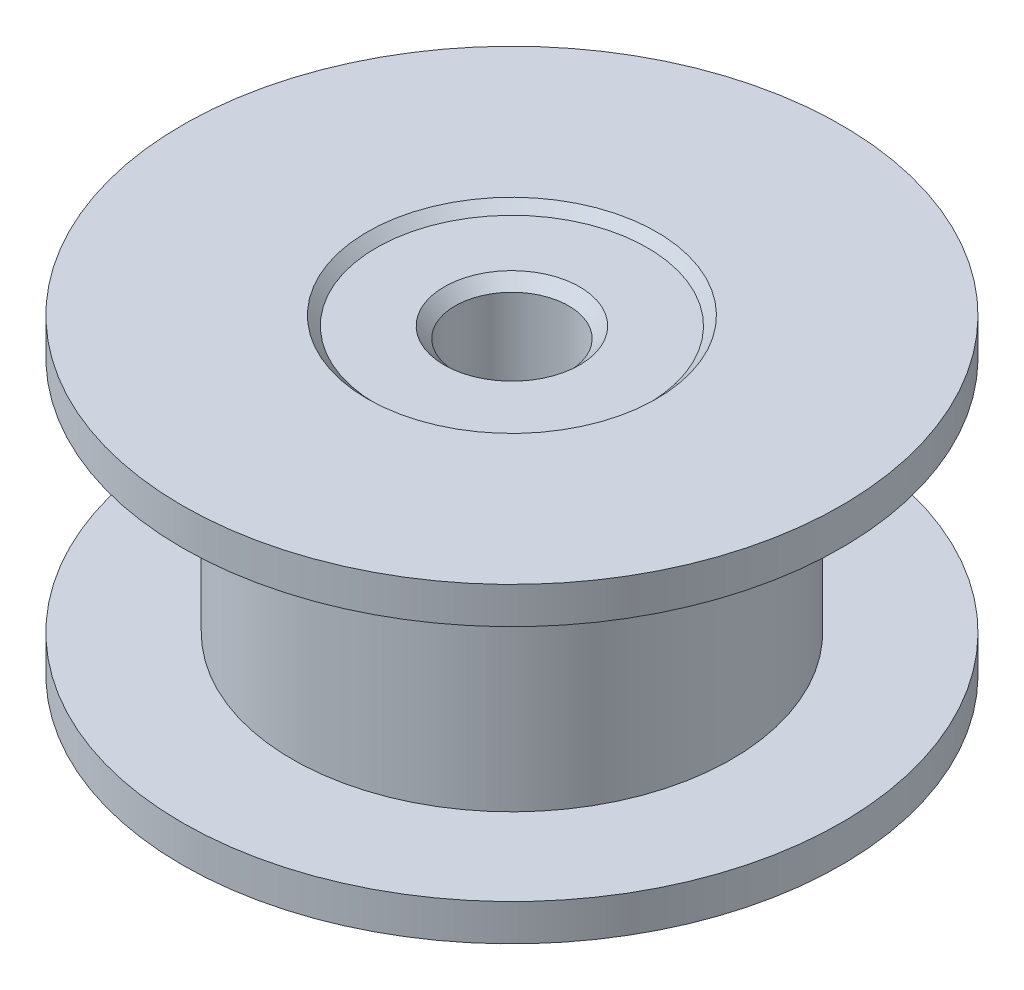
ISO-10303-21;
HEADER;
FILE_DESCRIPTION(('STEP AP214'),'2;1');
FILE_NAME('part.step','',(''),(''),'','','');
FILE_SCHEMA(('AUTOMOTIVE_DESIGN { 1 0 10303 214 1 1 1 1 }'));
ENDSEC;
DATA;
#1=APPLICATION_CONTEXT('core data for automotive mechanical design processes');
#2=APPLICATION_PROTOCOL_DEFINITION('international standard','automotive_design',2000,#1);
#3=PRODUCT_CONTEXT('',#1,'mechanical');
#4=PRODUCT('Part','Part','',(#3));
#5=PRODUCT_RELATED_PRODUCT_CATEGORY('part','',(#4));
#6=PRODUCT_DEFINITION_FORMATION('','',#4);
#7=PRODUCT_DEFINITION_CONTEXT('part definition',#1,'design');
#8=PRODUCT_DEFINITION('design','',#6,#7);
#9=PRODUCT_DEFINITION_SHAPE('','',#8);
#10=(LENGTH_UNIT() NAMED_UNIT(*) SI_UNIT(.MILLI.,.METRE.));
#11=(NAMED_UNIT(*) PLANE_ANGLE_UNIT() SI_UNIT($,.RADIAN.));
#12=(NAMED_UNIT(*) SI_UNIT($,.STERADIAN.) SOLID_ANGLE_UNIT());
#13=UNCERTAINTY_MEASURE_WITH_UNIT(LENGTH_MEASURE(1.E-05),#10,'distance_accuracy_value','');
#14=(GEOMETRIC_REPRESENTATION_CONTEXT(3) GLOBAL_UNCERTAINTY_ASSIGNED_CONTEXT((#13)) GLOBAL_UNIT_ASSIGNED_CONTEXT((#10,
#11,#12)) REPRESENTATION_CONTEXT('',''));
#15=CARTESIAN_POINT('',(0.,0.,0.));
#16=DIRECTION('',(0.,0.,1.));
#17=DIRECTION('',(1.,0.,0.));
#18=AXIS2_PLACEMENT_3D('',#15,#16,#17);
#19=CARTESIAN_POINT('',(0.,3.25,0.));
#20=DIRECTION('',(0.,-1.,0.));
#21=DIRECTION('',(0.,0.,-1.));
#22=AXIS2_PLACEMENT_3D('',#19,#20,#21);
#23=CYLINDRICAL_SURFACE('',#22,6.);
#24=CARTESIAN_POINT('',(0.,3.25,0.));
#25=DIRECTION('',(0.,1.,0.));
#26=DIRECTION('',(0.,0.,1.));
#27=AXIS2_PLACEMENT_3D('',#24,#25,#26);
#28=CIRCLE('',#27,6.);
#29=CARTESIAN_POINT('',(0.,3.25,-6.));
#30=VERTEX_POINT('',#29);
#31=EDGE_CURVE('E63',#30,#30,#28,.T.);
#32=CARTESIAN_POINT('',(0.,-3.25,0.));
#33=DIRECTION('',(0.,1.,0.));
#34=DIRECTION('',(0.,0.,1.));
#35=AXIS2_PLACEMENT_3D('',#32,#33,#34);
#36=CIRCLE('',#35,6.);
#37=CARTESIAN_POINT('',(0.,-3.25,-6.));
#38=VERTEX_POINT('',#37);
#39=EDGE_CURVE('E64',#38,#38,#36,.T.);
#40=CARTESIAN_POINT('',(0.,3.25,-6.));
#41=CARTESIAN_POINT('',(0.,3.18229166666667,-6.));
#42=CARTESIAN_POINT('',(0.,3.11458333333333,-6.));
#43=CARTESIAN_POINT('',(0.,2.97916666666667,-6.));
#44=CARTESIAN_POINT('',(0.,2.91145833333333,-6.));
#45=CARTESIAN_POINT('',(0.,2.77604166666667,-6.));
#46=CARTESIAN_POINT('',(0.,2.70833333333333,-6.));
#47=CARTESIAN_POINT('',(0.,2.57291666666667,-6.));
#48=CARTESIAN_POINT('',(0.,2.50520833333333,-6.));
#49=CARTESIAN_POINT('',(0.,2.36979166666667,-6.));
#50=CARTESIAN_POINT('',(0.,2.30208333333333,-6.));
#51=CARTESIAN_POINT('',(0.,2.16666666666667,-6.));
#52=CARTESIAN_POINT('',(0.,2.09895833333333,-6.));
#53=CARTESIAN_POINT('',(0.,1.96354166666667,-6.));
#54=CARTESIAN_POINT('',(0.,1.89583333333333,-6.));
#55=CARTESIAN_POINT('',(0.,1.76041666666667,-6.));
#56=CARTESIAN_POINT('',(0.,1.69270833333333,-6.));
#57=CARTESIAN_POINT('',(0.,1.55729166666667,-6.));
#58=CARTESIAN_POINT('',(0.,1.48958333333333,-6.));
#59=CARTESIAN_POINT('',(0.,1.35416666666667,-6.));
#60=CARTESIAN_POINT('',(0.,1.28645833333333,-6.));
#61=CARTESIAN_POINT('',(0.,1.15104166666667,-6.));
#62=CARTESIAN_POINT('',(0.,1.08333333333333,-6.));
#63=CARTESIAN_POINT('',(0.,0.947916666666667,-6.));
#64=CARTESIAN_POINT('',(0.,0.880208333333333,-6.));
#65=CARTESIAN_POINT('',(0.,0.744791666666667,-6.));
#66=CARTESIAN_POINT('',(0.,0.677083333333333,-6.));
#67=CARTESIAN_POINT('',(0.,0.541666666666667,-6.));
#68=CARTESIAN_POINT('',(0.,0.473958333333333,-6.));
#69=CARTESIAN_POINT('',(0.,0.338541666666667,-6.));
#70=CARTESIAN_POINT('',(0.,0.270833333333333,-6.));
#71=CARTESIAN_POINT('',(0.,0.135416666666667,-6.));
#72=CARTESIAN_POINT('',(0.,0.0677083333333334,-6.));
#73=CARTESIAN_POINT('',(0.,-0.0677083333333334,-6.));
#74=CARTESIAN_POINT('',(0.,-0.135416666666667,-6.));
#75=CARTESIAN_POINT('',(0.,-0.270833333333333,-6.));
#76=CARTESIAN_POINT('',(0.,-0.338541666666667,-6.));
#77=CARTESIAN_POINT('',(0.,-0.473958333333333,-6.));
#78=CARTESIAN_POINT('',(0.,-0.541666666666667,-6.));
#79=CARTESIAN_POINT('',(0.,-0.677083333333333,-6.));
#80=CARTESIAN_POINT('',(0.,-0.744791666666666,-6.));
#81=CARTESIAN_POINT('',(0.,-0.880208333333333,-6.));
#82=CARTESIAN_POINT('',(0.,-0.947916666666666,-6.));
#83=CARTESIAN_POINT('',(0.,-1.08333333333333,-6.));
#84=CARTESIAN_POINT('',(0.,-1.15104166666667,-6.));
#85=CARTESIAN_POINT('',(0.,-1.28645833333333,-6.));
#86=CARTESIAN_POINT('',(0.,-1.35416666666667,-6.));
#87=CARTESIAN_POINT('',(0.,-1.48958333333333,-6.));
#88=CARTESIAN_POINT('',(0.,-1.55729166666667,-6.));
#89=CARTESIAN_POINT('',(0.,-1.69270833333333,-6.));
#90=CARTESIAN_POINT('',(0.,-1.76041666666667,-6.));
#91=CARTESIAN_POINT('',(0.,-1.89583333333333,-6.));
#92=CARTESIAN_POINT('',(0.,-1.96354166666667,-6.));
#93=CARTESIAN_POINT('',(0.,-2.09895833333333,-6.));
#94=CARTESIAN_POINT('',(0.,-2.16666666666667,-6.));
#95=CARTESIAN_POINT('',(0.,-2.30208333333333,-6.));
#96=CARTESIAN_POINT('',(0.,-2.36979166666667,-6.));
#97=CARTESIAN_POINT('',(0.,-2.50520833333333,-6.));
#98=CARTESIAN_POINT('',(0.,-2.57291666666667,-6.));
#99=CARTESIAN_POINT('',(0.,-2.70833333333333,-6.));
#100=CARTESIAN_POINT('',(0.,-2.77604166666667,-6.));
#101=CARTESIAN_POINT('',(0.,-2.91145833333333,-6.));
#102=CARTESIAN_POINT('',(0.,-2.97916666666667,-6.));
#103=CARTESIAN_POINT('',(0.,-3.11458333333333,-6.));
#104=CARTESIAN_POINT('',(0.,-3.18229166666667,-6.));
#105=CARTESIAN_POINT('',(0.,-3.25,-6.));
#106=B_SPLINE_CURVE_WITH_KNOTS('',3,(#40,#41,#42,#43,#44,#45,#46,#47,#48,#49,#50,#51,#52,#53,
#54,#55,#56,#57,#58,#59,#60,#61,#62,#63,#64,#65,#66,#67,#68,#69,#70,#71,#72,#73,#74,#75,#76,#77,
#78,#79,#80,#81,#82,#83,#84,#85,#86,#87,#88,#89,#90,#91,#92,#93,#94,#95,#96,#97,#98,#99,#100,
#101,#102,#103,#104,#105),.UNSPECIFIED.,.F.,.F.,(4,2,2,2,2,2,2,2,2,2,2,2,2,2,2,2,2,2,2,2,2,2,2,
2,2,2,2,2,2,2,2,2,4),(0.,0.203125,0.40625,0.609375,0.8125,1.015625,1.21875,1.421875,1.625,
1.828125,2.03125,2.234375,2.4375,2.640625,2.84375,3.046875,3.25,3.453125,3.65625,3.859375,
4.0625,4.265625,4.46875,4.671875,4.875,5.078125,5.28125,5.484375,5.6875,5.890625,6.09375,
6.296875,6.5),.UNSPECIFIED.);
#107=EDGE_CURVE('BSEAM31',#30,#38,#106,.T.);
#108=ORIENTED_EDGE('',*,*,#31,.F.);
#109=ORIENTED_EDGE('',*,*,#39,.T.);
#110=ORIENTED_EDGE('',*,*,#107,.T.);
#111=ORIENTED_EDGE('',*,*,#107,.F.);
#112=EDGE_LOOP('',(#108,#110,#109,#111));
#113=FACE_BOUND('',#112,.T.);
#114=ADVANCED_FACE('F31',(#113),#23,.T.);
#115=CARTESIAN_POINT('',(0.,4.25,0.));
#116=DIRECTION('',(0.,-1.,0.));
#117=DIRECTION('',(0.,0.,-1.));
#118=AXIS2_PLACEMENT_3D('',#115,#116,#117);
#119=CYLINDRICAL_SURFACE('',#118,9.);
#120=CARTESIAN_POINT('',(0.,4.25,0.));
#121=DIRECTION('',(0.,1.,0.));
#122=DIRECTION('',(0.,0.,1.));
#123=AXIS2_PLACEMENT_3D('',#120,#121,#122);
#124=CIRCLE('',#123,9.);
#125=CARTESIAN_POINT('',(0.,4.25,9.));
#126=VERTEX_POINT('',#125);
#127=EDGE_CURVE('E71',#126,#126,#124,.T.);
#128=ORIENTED_EDGE('',*,*,#127,.F.);
#129=EDGE_LOOP('',(#128));
#130=FACE_BOUND('',#129,.T.);
#131=CARTESIAN_POINT('',(0.,3.25,0.));
#132=DIRECTION('',(0.,1.,0.));
#133=DIRECTION('',(0.,0.,1.));
#134=AXIS2_PLACEMENT_3D('',#131,#132,#133);
#135=CIRCLE('',#134,9.);
#136=CARTESIAN_POINT('',(0.,3.25,9.));
#137=VERTEX_POINT('',#136);
#138=EDGE_CURVE('E67',#137,#137,#135,.T.);
#139=ORIENTED_EDGE('',*,*,#138,.T.);
#140=EDGE_LOOP('',(#139));
#141=FACE_BOUND('',#140,.T.);
#142=ADVANCED_FACE('F100',(#130,#141),#119,.T.);
#143=CARTESIAN_POINT('',(0.,4.25,0.));
#144=DIRECTION('',(0.,1.,0.));
#145=DIRECTION('',(0.,0.,1.));
#146=AXIS2_PLACEMENT_3D('',#143,#144,#145);
#147=PLANE('',#146);
#148=CARTESIAN_POINT('',(0.,4.25,0.));
#149=DIRECTION('',(0.,1.,0.));
#150=DIRECTION('',(0.,0.,1.));
#151=AXIS2_PLACEMENT_3D('',#148,#149,#150);
#152=CIRCLE('',#151,3.95);
#153=CARTESIAN_POINT('',(0.,4.25,3.95));
#154=VERTEX_POINT('',#153);
#155=EDGE_CURVE('E38',#154,#154,#152,.F.);
#156=ORIENTED_EDGE('',*,*,#155,.T.);
#157=EDGE_LOOP('',(#156));
#158=FACE_BOUND('',#157,.T.);
#159=ORIENTED_EDGE('',*,*,#127,.T.);
#160=EDGE_LOOP('',(#159));
#161=FACE_BOUND('',#160,.T.);
#162=ADVANCED_FACE('F106',(#158,#161),#147,.T.);
#163=CARTESIAN_POINT('',(0.,3.25,0.));
#164=DIRECTION('',(0.,1.,0.));
#165=DIRECTION('',(0.,0.,1.));
#166=AXIS2_PLACEMENT_3D('',#163,#164,#165);
#167=PLANE('',#166);
#168=ORIENTED_EDGE('',*,*,#31,.T.);
#169=EDGE_LOOP('',(#168));
#170=FACE_BOUND('',#169,.T.);
#171=ORIENTED_EDGE('',*,*,#138,.F.);
#172=EDGE_LOOP('',(#171));
#173=FACE_BOUND('',#172,.T.);
#174=ADVANCED_FACE('F96',(#170,#173),#167,.F.);
#175=CARTESIAN_POINT('',(0.,-4.25,0.));
#176=DIRECTION('',(0.,1.,0.));
#177=DIRECTION('',(0.,0.,1.));
#178=AXIS2_PLACEMENT_3D('',#175,#176,#177);
#179=CYLINDRICAL_SURFACE('',#178,9.);
#180=CARTESIAN_POINT('',(0.,-4.25,0.));
#181=DIRECTION('',(0.,1.,0.));
#182=DIRECTION('',(0.,0.,1.));
#183=AXIS2_PLACEMENT_3D('',#180,#181,#182);
#184=CIRCLE('',#183,9.);
#185=CARTESIAN_POINT('',(0.,-4.25,9.));
#186=VERTEX_POINT('',#185);
#187=EDGE_CURVE('E68',#186,#186,#184,.T.);
#188=ORIENTED_EDGE('',*,*,#187,.T.);
#189=EDGE_LOOP('',(#188));
#190=FACE_BOUND('',#189,.T.);
#191=CARTESIAN_POINT('',(0.,-3.25,0.));
#192=DIRECTION('',(0.,1.,0.));
#193=DIRECTION('',(0.,0.,1.));
#194=AXIS2_PLACEMENT_3D('',#191,#192,#193);
#195=CIRCLE('',#194,9.);
#196=CARTESIAN_POINT('',(0.,-3.25,9.));
#197=VERTEX_POINT('',#196);
#198=EDGE_CURVE('E76',#197,#197,#195,.T.);
#199=ORIENTED_EDGE('',*,*,#198,.F.);
#200=EDGE_LOOP('',(#199));
#201=FACE_BOUND('',#200,.T.);
#202=ADVANCED_FACE('F82',(#190,#201),#179,.T.);
#203=CARTESIAN_POINT('',(0.,-4.25,0.));
#204=DIRECTION('',(0.,-1.,0.));
#205=DIRECTION('',(0.,0.,1.));
#206=AXIS2_PLACEMENT_3D('',#203,#204,#205);
#207=PLANE('',#206);
#208=CARTESIAN_POINT('',(0.,-4.25,0.));
#209=DIRECTION('',(0.,-1.,0.));
#210=DIRECTION('',(0.,0.,-1.));
#211=AXIS2_PLACEMENT_3D('',#208,#209,#210);
#212=CIRCLE('',#211,3.95);
#213=CARTESIAN_POINT('',(0.,-4.25,-3.95));
#214=VERTEX_POINT('',#213);
#215=EDGE_CURVE('E10',#214,#214,#212,.F.);
#216=ORIENTED_EDGE('',*,*,#215,.T.);
#217=EDGE_LOOP('',(#216));
#218=FACE_BOUND('',#217,.T.);
#219=ORIENTED_EDGE('',*,*,#187,.F.);
#220=EDGE_LOOP('',(#219));
#221=FACE_BOUND('',#220,.T.);
#222=ADVANCED_FACE('F85',(#218,#221),#207,.T.);
#223=CARTESIAN_POINT('',(0.,-3.25,0.));
#224=DIRECTION('',(0.,-1.,0.));
#225=DIRECTION('',(0.,0.,1.));
#226=AXIS2_PLACEMENT_3D('',#223,#224,#225);
#227=PLANE('',#226);
#228=ORIENTED_EDGE('',*,*,#39,.F.);
#229=EDGE_LOOP('',(#228));
#230=FACE_BOUND('',#229,.T.);
#231=ORIENTED_EDGE('',*,*,#198,.T.);
#232=EDGE_LOOP('',(#231));
#233=FACE_BOUND('',#232,.T.);
#234=ADVANCED_FACE('F87',(#230,#233),#227,.F.);
#235=CARTESIAN_POINT('',(0.,-4.,0.));
#236=DIRECTION('',(0.,1.,0.));
#237=DIRECTION('',(0.,0.,1.));
#238=AXIS2_PLACEMENT_3D('',#235,#236,#237);
#239=PLANE('',#238);
#240=CARTESIAN_POINT('',(0.,-4.,0.));
#241=DIRECTION('',(0.,1.,0.));
#242=DIRECTION('',(0.,0.,1.));
#243=AXIS2_PLACEMENT_3D('',#240,#241,#242);
#244=CIRCLE('',#243,3.69999999999999);
#245=CARTESIAN_POINT('',(0.,-4.,3.69999999999999));
#246=VERTEX_POINT('',#245);
#247=EDGE_CURVE('E51',#246,#246,#244,.F.);
#248=ORIENTED_EDGE('',*,*,#247,.T.);
#249=EDGE_LOOP('',(#248));
#250=FACE_BOUND('',#249,.T.);
#251=CARTESIAN_POINT('',(0.,-4.,0.));
#252=DIRECTION('',(0.,1.,0.));
#253=DIRECTION('',(0.,0.,1.));
#254=AXIS2_PLACEMENT_3D('',#251,#252,#253);
#255=CIRCLE('',#254,1.85);
#256=CARTESIAN_POINT('',(0.,-4.,1.85));
#257=VERTEX_POINT('',#256);
#258=EDGE_CURVE('E54',#257,#257,#255,.T.);
#259=ORIENTED_EDGE('',*,*,#258,.T.);
#260=EDGE_LOOP('',(#259));
#261=FACE_BOUND('',#260,.T.);
#262=ADVANCED_FACE('F93',(#250,#261),#239,.F.);
#263=CARTESIAN_POINT('',(0.,4.,0.));
#264=DIRECTION('',(0.,1.,0.));
#265=DIRECTION('',(0.,0.,1.));
#266=AXIS2_PLACEMENT_3D('',#263,#264,#265);
#267=PLANE('',#266);
#268=CARTESIAN_POINT('',(0.,4.,0.));
#269=DIRECTION('',(0.,1.,0.));
#270=DIRECTION('',(0.,0.,1.));
#271=AXIS2_PLACEMENT_3D('',#268,#269,#270);
#272=CIRCLE('',#271,3.69999999999999);
#273=CARTESIAN_POINT('',(0.,4.,3.69999999999999));
#274=VERTEX_POINT('',#273);
#275=EDGE_CURVE('E57',#274,#274,#272,.T.);
#276=ORIENTED_EDGE('',*,*,#275,.T.);
#277=EDGE_LOOP('',(#276));
#278=FACE_BOUND('',#277,.T.);
#279=CARTESIAN_POINT('',(0.,4.,0.));
#280=DIRECTION('',(0.,1.,0.));
#281=DIRECTION('',(0.,0.,1.));
#282=AXIS2_PLACEMENT_3D('',#279,#280,#281);
#283=CIRCLE('',#282,1.85);
#284=CARTESIAN_POINT('',(0.,4.,1.85));
#285=VERTEX_POINT('',#284);
#286=EDGE_CURVE('E60',#285,#285,#283,.F.);
#287=ORIENTED_EDGE('',*,*,#286,.T.);
#288=EDGE_LOOP('',(#287));
#289=FACE_BOUND('',#288,.T.);
#290=ADVANCED_FACE('F133',(#278,#289),#267,.T.);
#291=CARTESIAN_POINT('',(0.,-4.,0.));
#292=DIRECTION('',(0.,1.,0.));
#293=DIRECTION('',(0.,0.,1.));
#294=AXIS2_PLACEMENT_3D('',#291,#292,#293);
#295=CYLINDRICAL_SURFACE('',#294,1.55);
#296=CARTESIAN_POINT('',(0.,-3.7,0.));
#297=DIRECTION('',(0.,1.,0.));
#298=DIRECTION('',(0.,0.,1.));
#299=AXIS2_PLACEMENT_3D('',#296,#297,#298);
#300=CIRCLE('',#299,1.55);
#301=CARTESIAN_POINT('',(0.,-3.7,1.55));
#302=VERTEX_POINT('',#301);
#303=EDGE_CURVE('E42',#302,#302,#300,.F.);
#304=ORIENTED_EDGE('',*,*,#303,.T.);
#305=EDGE_LOOP('',(#304));
#306=FACE_BOUND('',#305,.T.);
#307=CARTESIAN_POINT('',(0.,3.70000000000001,0.));
#308=DIRECTION('',(0.,1.,0.));
#309=DIRECTION('',(0.,0.,1.));
#310=AXIS2_PLACEMENT_3D('',#307,#308,#309);
#311=CIRCLE('',#310,1.55);
#312=CARTESIAN_POINT('',(0.,3.70000000000001,1.55));
#313=VERTEX_POINT('',#312);
#314=EDGE_CURVE('E46',#313,#313,#311,.T.);
#315=ORIENTED_EDGE('',*,*,#314,.T.);
#316=EDGE_LOOP('',(#315));
#317=FACE_BOUND('',#316,.T.);
#318=ADVANCED_FACE('F117',(#306,#317),#295,.F.);
#319=CARTESIAN_POINT('',(0.,4.,0.));
#320=DIRECTION('',(0.,1.,0.));
#321=DIRECTION('',(0.,0.,1.));
#322=AXIS2_PLACEMENT_3D('',#319,#320,#321);
#323=CONICAL_SURFACE('',#322,3.69999999999999,0.785398163397454);
#324=ORIENTED_EDGE('',*,*,#155,.F.);
#325=EDGE_LOOP('',(#324));
#326=FACE_BOUND('',#325,.T.);
#327=ORIENTED_EDGE('',*,*,#275,.F.);
#328=EDGE_LOOP('',(#327));
#329=FACE_BOUND('',#328,.T.);
#330=ADVANCED_FACE('F113',(#326,#329),#323,.F.);
#331=CARTESIAN_POINT('',(0.,-4.,0.));
#332=DIRECTION('',(0.,-1.,0.));
#333=DIRECTION('',(0.,0.,-1.));
#334=AXIS2_PLACEMENT_3D('',#331,#332,#333);
#335=CONICAL_SURFACE('',#334,3.69999999999999,0.785398163397454);
#336=ORIENTED_EDGE('',*,*,#215,.F.);
#337=EDGE_LOOP('',(#336));
#338=FACE_BOUND('',#337,.T.);
#339=ORIENTED_EDGE('',*,*,#247,.F.);
#340=EDGE_LOOP('',(#339));
#341=FACE_BOUND('',#340,.T.);
#342=ADVANCED_FACE('F116',(#338,#341),#335,.F.);
#343=CARTESIAN_POINT('',(0.,-4.,0.));
#344=DIRECTION('',(0.,-1.,0.));
#345=DIRECTION('',(0.,0.,-1.));
#346=AXIS2_PLACEMENT_3D('',#343,#344,#345);
#347=CONICAL_SURFACE('',#346,1.85,0.785398163397441);
#348=ORIENTED_EDGE('',*,*,#303,.F.);
#349=EDGE_LOOP('',(#348));
#350=FACE_BOUND('',#349,.T.);
#351=ORIENTED_EDGE('',*,*,#258,.F.);
#352=EDGE_LOOP('',(#351));
#353=FACE_BOUND('',#352,.T.);
#354=ADVANCED_FACE('F120',(#350,#353),#347,.F.);
#355=CARTESIAN_POINT('',(0.,3.70000000000001,0.));
#356=DIRECTION('',(0.,1.,0.));
#357=DIRECTION('',(0.,0.,1.));
#358=AXIS2_PLACEMENT_3D('',#355,#356,#357);
#359=CONICAL_SURFACE('',#358,1.55,0.785398163397453);
#360=ORIENTED_EDGE('',*,*,#286,.F.);
#361=EDGE_LOOP('',(#360));
#362=FACE_BOUND('',#361,.T.);
#363=ORIENTED_EDGE('',*,*,#314,.F.);
#364=EDGE_LOOP('',(#363));
#365=FACE_BOUND('',#364,.T.);
#366=ADVANCED_FACE('F33',(#362,#365),#359,.F.);
#367=CLOSED_SHELL('',(#114,#142,#162,#174,#202,#222,#234,#262,#290,#318,#330,#342,#354,#366));
#368=MANIFOLD_SOLID_BREP('B2',#367);
#369=ADVANCED_BREP_SHAPE_REPRESENTATION('',(#18,#368),#14);
#370=SHAPE_DEFINITION_REPRESENTATION(#9,#369);
ENDSEC;
END-ISO-10303-21;
